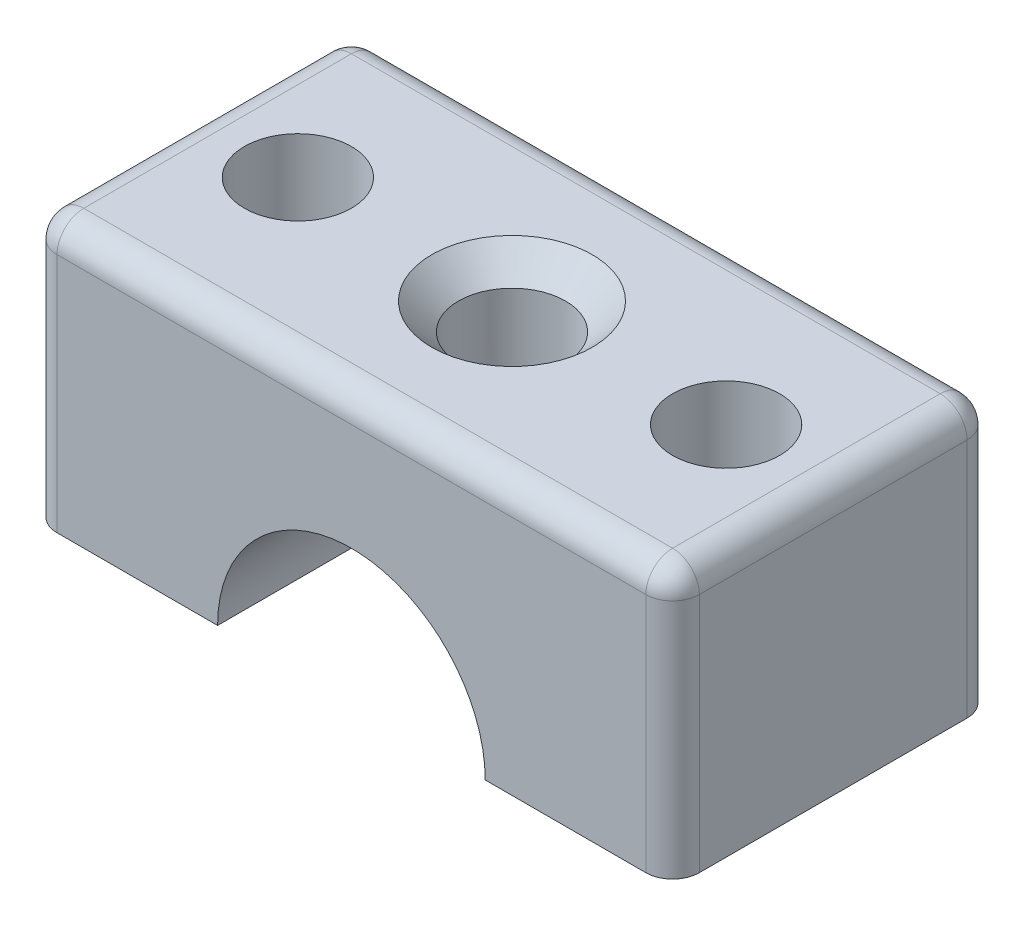
ISO-10303-21;
HEADER;
FILE_DESCRIPTION(('STEP AP214'),'2;1');
FILE_NAME('part.step','',(''),(''),'','','');
FILE_SCHEMA(('AUTOMOTIVE_DESIGN { 1 0 10303 214 1 1 1 1 }'));
ENDSEC;
DATA;
#1=APPLICATION_CONTEXT('core data for automotive mechanical design processes');
#2=APPLICATION_PROTOCOL_DEFINITION('international standard','automotive_design',2000,#1);
#3=PRODUCT_CONTEXT('',#1,'mechanical');
#4=PRODUCT('Part','Part','',(#3));
#5=PRODUCT_RELATED_PRODUCT_CATEGORY('part','',(#4));
#6=PRODUCT_DEFINITION_FORMATION('','',#4);
#7=PRODUCT_DEFINITION_CONTEXT('part definition',#1,'design');
#8=PRODUCT_DEFINITION('design','',#6,#7);
#9=PRODUCT_DEFINITION_SHAPE('','',#8);
#10=(LENGTH_UNIT() NAMED_UNIT(*) SI_UNIT(.MILLI.,.METRE.));
#11=(NAMED_UNIT(*) PLANE_ANGLE_UNIT() SI_UNIT($,.RADIAN.));
#12=(NAMED_UNIT(*) SI_UNIT($,.STERADIAN.) SOLID_ANGLE_UNIT());
#13=UNCERTAINTY_MEASURE_WITH_UNIT(LENGTH_MEASURE(1.E-05),#10,'distance_accuracy_value','');
#14=(GEOMETRIC_REPRESENTATION_CONTEXT(3) GLOBAL_UNCERTAINTY_ASSIGNED_CONTEXT((#13)) GLOBAL_UNIT_ASSIGNED_CONTEXT((#10,
#11,#12)) REPRESENTATION_CONTEXT('',''));
#15=CARTESIAN_POINT('',(0.,0.,0.));
#16=DIRECTION('',(0.,0.,1.));
#17=DIRECTION('',(1.,0.,0.));
#18=AXIS2_PLACEMENT_3D('',#15,#16,#17);
#19=CARTESIAN_POINT('',(0.,0.,0.));
#20=DIRECTION('',(0.,1.,0.));
#21=DIRECTION('',(0.,0.,1.));
#22=AXIS2_PLACEMENT_3D('',#19,#20,#21);
#23=PLANE('',#22);
#24=CARTESIAN_POINT('',(8.,0.,0.));
#25=DIRECTION('',(0.,1.,0.));
#26=DIRECTION('',(0.,0.,1.));
#27=AXIS2_PLACEMENT_3D('',#24,#25,#26);
#28=CIRCLE('',#27,2.);
#29=CARTESIAN_POINT('',(8.,0.,2.));
#30=VERTEX_POINT('',#29);
#31=EDGE_CURVE('E291',#30,#30,#28,.T.);
#32=ORIENTED_EDGE('',*,*,#31,.T.);
#33=EDGE_LOOP('',(#32));
#34=FACE_BOUND('',#33,.T.);
#35=DIRECTION('',(1.,0.,0.));
#36=VECTOR('',#35,1.);
#37=CARTESIAN_POINT('',(-12.,0.,6.));
#38=LINE('',#37,#36);
#39=CARTESIAN_POINT('',(5.,0.,6.));
#40=VERTEX_POINT('',#39);
#41=CARTESIAN_POINT('',(11.,0.,6.));
#42=VERTEX_POINT('',#41);
#43=EDGE_CURVE('E163',#40,#42,#38,.T.);
#44=ORIENTED_EDGE('',*,*,#43,.F.);
#45=DIRECTION('',(0.,0.,-1.));
#46=VECTOR('',#45,1.);
#47=CARTESIAN_POINT('',(5.,0.,6.));
#48=LINE('',#47,#46);
#49=CARTESIAN_POINT('',(5.,0.,-6.));
#50=VERTEX_POINT('',#49);
#51=EDGE_CURVE('E66',#40,#50,#48,.T.);
#52=ORIENTED_EDGE('',*,*,#51,.T.);
#53=DIRECTION('',(-1.,0.,0.));
#54=VECTOR('',#53,1.);
#55=CARTESIAN_POINT('',(-12.,0.,-6.));
#56=LINE('',#55,#54);
#57=CARTESIAN_POINT('',(11.,0.,-6.));
#58=VERTEX_POINT('',#57);
#59=EDGE_CURVE('E305',#58,#50,#56,.T.);
#60=ORIENTED_EDGE('',*,*,#59,.F.);
#61=CARTESIAN_POINT('',(11.,0.,-5.));
#62=DIRECTION('',(0.,1.,0.));
#63=DIRECTION('',(0.,0.,1.));
#64=AXIS2_PLACEMENT_3D('',#61,#62,#63);
#65=CIRCLE('',#64,1.);
#66=CARTESIAN_POINT('',(12.,0.,-5.));
#67=VERTEX_POINT('',#66);
#68=EDGE_CURVE('E194',#58,#67,#65,.F.);
#69=ORIENTED_EDGE('',*,*,#68,.T.);
#70=DIRECTION('',(0.,0.,-1.));
#71=VECTOR('',#70,1.);
#72=CARTESIAN_POINT('',(12.,0.,-6.));
#73=LINE('',#72,#71);
#74=CARTESIAN_POINT('',(12.,0.,5.));
#75=VERTEX_POINT('',#74);
#76=EDGE_CURVE('E299',#75,#67,#73,.T.);
#77=ORIENTED_EDGE('',*,*,#76,.F.);
#78=CARTESIAN_POINT('',(11.,0.,5.));
#79=DIRECTION('',(0.,1.,0.));
#80=DIRECTION('',(0.,0.,1.));
#81=AXIS2_PLACEMENT_3D('',#78,#79,#80);
#82=CIRCLE('',#81,1.);
#83=EDGE_CURVE('E190',#75,#42,#82,.F.);
#84=ORIENTED_EDGE('',*,*,#83,.T.);
#85=EDGE_LOOP('',(#44,#52,#60,#69,#77,#84));
#86=FACE_BOUND('',#85,.T.);
#87=ADVANCED_FACE('F43',(#34,#86),#23,.F.);
#88=CARTESIAN_POINT('',(0.,10.,0.));
#89=DIRECTION('',(0.,1.,0.));
#90=DIRECTION('',(0.,0.,1.));
#91=AXIS2_PLACEMENT_3D('',#88,#89,#90);
#92=PLANE('',#91);
#93=DIRECTION('',(-1.,0.,0.));
#94=VECTOR('',#93,1.);
#95=CARTESIAN_POINT('',(-12.,10.,-5.));
#96=LINE('',#95,#94);
#97=CARTESIAN_POINT('',(11.,10.,-5.));
#98=VERTEX_POINT('',#97);
#99=CARTESIAN_POINT('',(-11.,10.,-5.));
#100=VERTEX_POINT('',#99);
#101=EDGE_CURVE('E58',#98,#100,#96,.T.);
#102=ORIENTED_EDGE('',*,*,#101,.T.);
#103=DIRECTION('',(0.,0.,1.));
#104=VECTOR('',#103,1.);
#105=CARTESIAN_POINT('',(-11.,10.,6.));
#106=LINE('',#105,#104);
#107=CARTESIAN_POINT('',(-11.,10.,5.));
#108=VERTEX_POINT('',#107);
#109=EDGE_CURVE('E11',#100,#108,#106,.T.);
#110=ORIENTED_EDGE('',*,*,#109,.T.);
#111=DIRECTION('',(1.,0.,0.));
#112=VECTOR('',#111,1.);
#113=CARTESIAN_POINT('',(12.,10.,5.));
#114=LINE('',#113,#112);
#115=CARTESIAN_POINT('',(11.,10.,5.));
#116=VERTEX_POINT('',#115);
#117=EDGE_CURVE('E226',#108,#116,#114,.T.);
#118=ORIENTED_EDGE('',*,*,#117,.T.);
#119=DIRECTION('',(0.,0.,-1.));
#120=VECTOR('',#119,1.);
#121=CARTESIAN_POINT('',(11.,10.,-6.));
#122=LINE('',#121,#120);
#123=EDGE_CURVE('E229',#116,#98,#122,.T.);
#124=ORIENTED_EDGE('',*,*,#123,.T.);
#125=EDGE_LOOP('',(#102,#110,#118,#124));
#126=FACE_BOUND('',#125,.T.);
#127=CARTESIAN_POINT('',(0.,10.,0.));
#128=DIRECTION('',(0.,1.,0.));
#129=DIRECTION('',(0.,0.,1.));
#130=AXIS2_PLACEMENT_3D('',#127,#128,#129);
#131=CIRCLE('',#130,3.);
#132=CARTESIAN_POINT('',(0.,10.,3.));
#133=VERTEX_POINT('',#132);
#134=EDGE_CURVE('E168',#133,#133,#131,.F.);
#135=ORIENTED_EDGE('',*,*,#134,.T.);
#136=EDGE_LOOP('',(#135));
#137=FACE_BOUND('',#136,.T.);
#138=CARTESIAN_POINT('',(-8.,10.,0.));
#139=DIRECTION('',(0.,1.,0.));
#140=DIRECTION('',(0.,0.,1.));
#141=AXIS2_PLACEMENT_3D('',#138,#139,#140);
#142=CIRCLE('',#141,2.);
#143=CARTESIAN_POINT('',(-8.,10.,2.));
#144=VERTEX_POINT('',#143);
#145=EDGE_CURVE('E286',#144,#144,#142,.T.);
#146=ORIENTED_EDGE('',*,*,#145,.F.);
#147=EDGE_LOOP('',(#146));
#148=FACE_BOUND('',#147,.T.);
#149=CARTESIAN_POINT('',(8.,10.,0.));
#150=DIRECTION('',(0.,1.,0.));
#151=DIRECTION('',(0.,0.,1.));
#152=AXIS2_PLACEMENT_3D('',#149,#150,#151);
#153=CIRCLE('',#152,2.);
#154=CARTESIAN_POINT('',(8.,10.,2.));
#155=VERTEX_POINT('',#154);
#156=EDGE_CURVE('E295',#155,#155,#153,.T.);
#157=ORIENTED_EDGE('',*,*,#156,.F.);
#158=EDGE_LOOP('',(#157));
#159=FACE_BOUND('',#158,.T.);
#160=ADVANCED_FACE('F376',(#126,#137,#148,#159),#92,.T.);
#161=CARTESIAN_POINT('',(-5.,0.,-6.));
#162=VERTEX_POINT('',#161);
#163=CARTESIAN_POINT('',(-11.,0.,-6.));
#164=VERTEX_POINT('',#163);
#165=EDGE_CURVE('E155',#162,#164,#56,.T.);
#166=ORIENTED_EDGE('',*,*,#165,.F.);
#167=DIRECTION('',(0.,0.,-1.));
#168=VECTOR('',#167,1.);
#169=CARTESIAN_POINT('',(-5.,0.,6.));
#170=LINE('',#169,#168);
#171=CARTESIAN_POINT('',(-5.,0.,6.));
#172=VERTEX_POINT('',#171);
#173=EDGE_CURVE('E139',#172,#162,#170,.T.);
#174=ORIENTED_EDGE('',*,*,#173,.F.);
#175=CARTESIAN_POINT('',(-11.,0.,6.));
#176=VERTEX_POINT('',#175);
#177=EDGE_CURVE('E152',#176,#172,#38,.T.);
#178=ORIENTED_EDGE('',*,*,#177,.F.);
#179=CARTESIAN_POINT('',(-11.,0.,5.));
#180=DIRECTION('',(0.,1.,0.));
#181=DIRECTION('',(0.,0.,1.));
#182=AXIS2_PLACEMENT_3D('',#179,#180,#181);
#183=CIRCLE('',#182,1.);
#184=CARTESIAN_POINT('',(-12.,0.,5.));
#185=VERTEX_POINT('',#184);
#186=EDGE_CURVE('E187',#176,#185,#183,.F.);
#187=ORIENTED_EDGE('',*,*,#186,.T.);
#188=DIRECTION('',(0.,0.,1.));
#189=VECTOR('',#188,1.);
#190=CARTESIAN_POINT('',(-12.,0.,-6.));
#191=LINE('',#190,#189);
#192=CARTESIAN_POINT('',(-12.,0.,-5.));
#193=VERTEX_POINT('',#192);
#194=EDGE_CURVE('E170',#193,#185,#191,.T.);
#195=ORIENTED_EDGE('',*,*,#194,.F.);
#196=CARTESIAN_POINT('',(-11.,0.,-5.));
#197=DIRECTION('',(0.,1.,0.));
#198=DIRECTION('',(0.,0.,1.));
#199=AXIS2_PLACEMENT_3D('',#196,#197,#198);
#200=CIRCLE('',#199,1.);
#201=EDGE_CURVE('E197',#193,#164,#200,.F.);
#202=ORIENTED_EDGE('',*,*,#201,.T.);
#203=EDGE_LOOP('',(#166,#174,#178,#187,#195,#202));
#204=FACE_BOUND('',#203,.T.);
#205=CARTESIAN_POINT('',(-8.,0.,0.));
#206=DIRECTION('',(0.,1.,0.));
#207=DIRECTION('',(0.,0.,1.));
#208=AXIS2_PLACEMENT_3D('',#205,#206,#207);
#209=CIRCLE('',#208,2.);
#210=CARTESIAN_POINT('',(-8.,0.,2.));
#211=VERTEX_POINT('',#210);
#212=EDGE_CURVE('E279',#211,#211,#209,.T.);
#213=ORIENTED_EDGE('',*,*,#212,.T.);
#214=EDGE_LOOP('',(#213));
#215=FACE_BOUND('',#214,.T.);
#216=ADVANCED_FACE('F150',(#204,#215),#23,.F.);
#217=CARTESIAN_POINT('',(12.,10.,-6.));
#218=DIRECTION('',(-1.,0.,0.));
#219=DIRECTION('',(0.,0.,1.));
#220=AXIS2_PLACEMENT_3D('',#217,#218,#219);
#221=PLANE('',#220);
#222=ORIENTED_EDGE('',*,*,#76,.T.);
#223=DIRECTION('',(0.,-1.,0.));
#224=VECTOR('',#223,1.);
#225=CARTESIAN_POINT('',(12.,10.,-5.));
#226=LINE('',#225,#224);
#227=CARTESIAN_POINT('',(12.,9.,-5.));
#228=VERTEX_POINT('',#227);
#229=EDGE_CURVE('E215',#67,#228,#226,.F.);
#230=ORIENTED_EDGE('',*,*,#229,.T.);
#231=DIRECTION('',(0.,0.,-1.));
#232=VECTOR('',#231,1.);
#233=CARTESIAN_POINT('',(12.,9.,6.));
#234=LINE('',#233,#232);
#235=CARTESIAN_POINT('',(12.,9.,5.));
#236=VERTEX_POINT('',#235);
#237=EDGE_CURVE('E209',#228,#236,#234,.F.);
#238=ORIENTED_EDGE('',*,*,#237,.T.);
#239=DIRECTION('',(0.,-1.,0.));
#240=VECTOR('',#239,1.);
#241=CARTESIAN_POINT('',(12.,10.,5.));
#242=LINE('',#241,#240);
#243=EDGE_CURVE('E212',#236,#75,#242,.T.);
#244=ORIENTED_EDGE('',*,*,#243,.T.);
#245=EDGE_LOOP('',(#222,#230,#238,#244));
#246=FACE_BOUND('',#245,.T.);
#247=ADVANCED_FACE('F343',(#246),#221,.F.);
#248=CARTESIAN_POINT('',(-12.,10.,-6.));
#249=DIRECTION('',(0.,0.,1.));
#250=DIRECTION('',(1.,0.,0.));
#251=AXIS2_PLACEMENT_3D('',#248,#249,#250);
#252=PLANE('',#251);
#253=ORIENTED_EDGE('',*,*,#59,.T.);
#254=CARTESIAN_POINT('',(0.,0.,-6.));
#255=DIRECTION('',(0.,0.,-1.));
#256=DIRECTION('',(-1.,0.,0.));
#257=AXIS2_PLACEMENT_3D('',#254,#255,#256);
#258=CIRCLE('',#257,5.);
#259=EDGE_CURVE('E145',#162,#50,#258,.T.);
#260=ORIENTED_EDGE('',*,*,#259,.F.);
#261=ORIENTED_EDGE('',*,*,#165,.T.);
#262=DIRECTION('',(0.,-1.,0.));
#263=VECTOR('',#262,1.);
#264=CARTESIAN_POINT('',(-11.,10.,-6.));
#265=LINE('',#264,#263);
#266=CARTESIAN_POINT('',(-11.,9.,-6.));
#267=VERTEX_POINT('',#266);
#268=EDGE_CURVE('E206',#164,#267,#265,.F.);
#269=ORIENTED_EDGE('',*,*,#268,.T.);
#270=DIRECTION('',(-1.,0.,0.));
#271=VECTOR('',#270,1.);
#272=CARTESIAN_POINT('',(12.,9.,-6.));
#273=LINE('',#272,#271);
#274=CARTESIAN_POINT('',(11.,9.,-6.));
#275=VERTEX_POINT('',#274);
#276=EDGE_CURVE('E200',#267,#275,#273,.F.);
#277=ORIENTED_EDGE('',*,*,#276,.T.);
#278=DIRECTION('',(0.,-1.,0.));
#279=VECTOR('',#278,1.);
#280=CARTESIAN_POINT('',(11.,10.,-6.));
#281=LINE('',#280,#279);
#282=EDGE_CURVE('E203',#275,#58,#281,.T.);
#283=ORIENTED_EDGE('',*,*,#282,.T.);
#284=EDGE_LOOP('',(#253,#260,#261,#269,#277,#283));
#285=FACE_BOUND('',#284,.T.);
#286=ADVANCED_FACE('F313',(#285),#252,.F.);
#287=CARTESIAN_POINT('',(-12.,10.,-6.));
#288=DIRECTION('',(1.,0.,0.));
#289=DIRECTION('',(0.,0.,-1.));
#290=AXIS2_PLACEMENT_3D('',#287,#288,#289);
#291=PLANE('',#290);
#292=DIRECTION('',(0.,0.,1.));
#293=VECTOR('',#292,1.);
#294=CARTESIAN_POINT('',(-12.,9.,-6.));
#295=LINE('',#294,#293);
#296=CARTESIAN_POINT('',(-12.,9.,5.));
#297=VERTEX_POINT('',#296);
#298=CARTESIAN_POINT('',(-12.,9.,-5.));
#299=VERTEX_POINT('',#298);
#300=EDGE_CURVE('E177',#297,#299,#295,.F.);
#301=ORIENTED_EDGE('',*,*,#300,.T.);
#302=DIRECTION('',(0.,-1.,0.));
#303=VECTOR('',#302,1.);
#304=CARTESIAN_POINT('',(-12.,10.,-5.));
#305=LINE('',#304,#303);
#306=EDGE_CURVE('E183',#299,#193,#305,.T.);
#307=ORIENTED_EDGE('',*,*,#306,.T.);
#308=ORIENTED_EDGE('',*,*,#194,.T.);
#309=DIRECTION('',(0.,-1.,0.));
#310=VECTOR('',#309,1.);
#311=CARTESIAN_POINT('',(-12.,10.,5.));
#312=LINE('',#311,#310);
#313=EDGE_CURVE('E180',#185,#297,#312,.F.);
#314=ORIENTED_EDGE('',*,*,#313,.T.);
#315=EDGE_LOOP('',(#301,#307,#308,#314));
#316=FACE_BOUND('',#315,.T.);
#317=ADVANCED_FACE('F391',(#316),#291,.F.);
#318=CARTESIAN_POINT('',(-12.,10.,6.));
#319=DIRECTION('',(0.,0.,-1.));
#320=DIRECTION('',(-1.,0.,0.));
#321=AXIS2_PLACEMENT_3D('',#318,#319,#320);
#322=PLANE('',#321);
#323=ORIENTED_EDGE('',*,*,#177,.T.);
#324=CARTESIAN_POINT('',(0.,0.,6.));
#325=DIRECTION('',(0.,0.,-1.));
#326=DIRECTION('',(-1.,0.,0.));
#327=AXIS2_PLACEMENT_3D('',#324,#325,#326);
#328=CIRCLE('',#327,5.);
#329=EDGE_CURVE('E136',#172,#40,#328,.T.);
#330=ORIENTED_EDGE('',*,*,#329,.T.);
#331=ORIENTED_EDGE('',*,*,#43,.T.);
#332=DIRECTION('',(0.,-1.,0.));
#333=VECTOR('',#332,1.);
#334=CARTESIAN_POINT('',(11.,10.,6.));
#335=LINE('',#334,#333);
#336=CARTESIAN_POINT('',(11.,9.,6.));
#337=VERTEX_POINT('',#336);
#338=EDGE_CURVE('E223',#42,#337,#335,.F.);
#339=ORIENTED_EDGE('',*,*,#338,.T.);
#340=DIRECTION('',(1.,0.,0.));
#341=VECTOR('',#340,1.);
#342=CARTESIAN_POINT('',(-12.,9.,6.));
#343=LINE('',#342,#341);
#344=CARTESIAN_POINT('',(-11.,9.,6.));
#345=VERTEX_POINT('',#344);
#346=EDGE_CURVE('E218',#337,#345,#343,.F.);
#347=ORIENTED_EDGE('',*,*,#346,.T.);
#348=DIRECTION('',(0.,-1.,0.));
#349=VECTOR('',#348,1.);
#350=CARTESIAN_POINT('',(-11.,10.,6.));
#351=LINE('',#350,#349);
#352=EDGE_CURVE('E160',#345,#176,#351,.T.);
#353=ORIENTED_EDGE('',*,*,#352,.T.);
#354=EDGE_LOOP('',(#323,#330,#331,#339,#347,#353));
#355=FACE_BOUND('',#354,.T.);
#356=ADVANCED_FACE('F158',(#355),#322,.F.);
#357=CARTESIAN_POINT('',(8.,10.,0.));
#358=DIRECTION('',(0.,-1.,0.));
#359=DIRECTION('',(0.,0.,-1.));
#360=AXIS2_PLACEMENT_3D('',#357,#358,#359);
#361=CYLINDRICAL_SURFACE('',#360,2.);
#362=ORIENTED_EDGE('',*,*,#156,.T.);
#363=EDGE_LOOP('',(#362));
#364=FACE_BOUND('',#363,.T.);
#365=ORIENTED_EDGE('',*,*,#31,.F.);
#366=EDGE_LOOP('',(#365));
#367=FACE_BOUND('',#366,.T.);
#368=ADVANCED_FACE('F397',(#364,#367),#361,.F.);
#369=CARTESIAN_POINT('',(-8.,10.,0.));
#370=DIRECTION('',(0.,-1.,0.));
#371=DIRECTION('',(0.,0.,-1.));
#372=AXIS2_PLACEMENT_3D('',#369,#370,#371);
#373=CYLINDRICAL_SURFACE('',#372,2.);
#374=ORIENTED_EDGE('',*,*,#145,.T.);
#375=EDGE_LOOP('',(#374));
#376=FACE_BOUND('',#375,.T.);
#377=ORIENTED_EDGE('',*,*,#212,.F.);
#378=EDGE_LOOP('',(#377));
#379=FACE_BOUND('',#378,.T.);
#380=ADVANCED_FACE('F361',(#376,#379),#373,.F.);
#381=CARTESIAN_POINT('',(0.,10.,0.));
#382=DIRECTION('',(0.,-1.,0.));
#383=DIRECTION('',(0.,0.,-1.));
#384=AXIS2_PLACEMENT_3D('',#381,#382,#383);
#385=CYLINDRICAL_SURFACE('',#384,2.);
#386=CARTESIAN_POINT('',(0.,5.,-2.));
#387=CARTESIAN_POINT('',(-0.107493005442891,4.99999271227084,-1.99999014817627));
#388=CARTESIAN_POINT('',(-0.215172564090673,4.99649294306932,-1.99128224791162));
#389=CARTESIAN_POINT('',(-0.427496480417896,4.98283453100642,-1.95675229647876));
#390=CARTESIAN_POINT('',(-0.532131777561248,4.97265778698877,-1.93088372091387));
#391=CARTESIAN_POINT('',(-0.734953922727403,4.94674209213118,-1.86312392194117));
#392=CARTESIAN_POINT('',(-0.833160661616959,4.93102136364072,-1.82128515378327));
#393=CARTESIAN_POINT('',(-1.02107197032837,4.89556610796078,-1.72298082667345));
#394=CARTESIAN_POINT('',(-1.11077947675099,4.87583297458057,-1.66652034508107));
#395=CARTESIAN_POINT('',(-1.28350100757039,4.83330886170419,-1.53776450143906));
#396=CARTESIAN_POINT('',(-1.36606227255021,4.8104229692919,-1.46489334375974));
#397=CARTESIAN_POINT('',(-1.51817500478472,4.76460576906194,-1.30659999652322));
#398=CARTESIAN_POINT('',(-1.58772010713353,4.74167444453792,-1.22117170278826));
#399=CARTESIAN_POINT('',(-1.71487456729288,4.69722791797136,-1.03557192975773));
#400=CARTESIAN_POINT('',(-1.77181498119547,4.67582115964951,-0.934913513976802));
#401=CARTESIAN_POINT('',(-1.86775471903715,4.63833647186792,-0.724463601579957));
#402=CARTESIAN_POINT('',(-1.90676256428583,4.62225601244176,-0.614676472151639));
#403=CARTESIAN_POINT('',(-1.96389882339587,4.59826357660818,-0.394287666407897));
#404=CARTESIAN_POINT('',(-1.98289396580565,4.59001420355605,-0.283948764423786));
#405=CARTESIAN_POINT('',(-2.00217296164003,4.58164004049144,-0.0613650016927319));
#406=CARTESIAN_POINT('',(-2.00246601631322,4.58151125522768,0.0508788946250152));
#407=CARTESIAN_POINT('',(-1.98498936750454,4.58910500279994,0.265756671458044));
#408=CARTESIAN_POINT('',(-1.96847531430514,4.5962817503845,0.368515714409031));
#409=CARTESIAN_POINT('',(-1.91994688029782,4.61676187607836,0.569659556006714));
#410=CARTESIAN_POINT('',(-1.88792979480463,4.63006632321673,0.668043588110308));
#411=CARTESIAN_POINT('',(-1.80869473255107,4.6615948508853,0.860017836196042));
#412=CARTESIAN_POINT('',(-1.76117986231532,4.67991379280788,0.953469239054691));
#413=CARTESIAN_POINT('',(-1.65250646073221,4.7193811638989,1.13141581636156));
#414=CARTESIAN_POINT('',(-1.59134280510084,4.74053065456848,1.21590760940281));
#415=CARTESIAN_POINT('',(-1.45155059945443,4.78526736742271,1.380409728802));
#416=CARTESIAN_POINT('',(-1.37193746297063,4.80891664976152,1.45956872944602));
#417=CARTESIAN_POINT('',(-1.20031442743019,4.85459824958282,1.60368447800204));
#418=CARTESIAN_POINT('',(-1.10830206533443,4.87663024445325,1.66863839741029));
#419=CARTESIAN_POINT('',(-0.912077652605842,4.91714681264548,1.78361744741583));
#420=CARTESIAN_POINT('',(-0.807660491346476,4.93555270095415,1.83332228119705));
#421=CARTESIAN_POINT('',(-0.591023765482881,4.96614828328759,1.91416786107806));
#422=CARTESIAN_POINT('',(-0.478808196849673,4.97834113462382,1.94531803755741));
#423=CARTESIAN_POINT('',(-0.256895887607819,4.99456139506911,1.9864482954197));
#424=CARTESIAN_POINT('',(-0.147443293985534,4.99902945833514,1.99757245425356));
#425=CARTESIAN_POINT('',(0.0718453098078178,5.00068478510631,2.00171310052861));
#426=CARTESIAN_POINT('',(0.181681213223924,4.99787393582291,1.99473428154751));
#427=CARTESIAN_POINT('',(0.393432739121988,4.98557567063753,1.96370824744801));
#428=CARTESIAN_POINT('',(0.495482491775475,4.97639391345523,1.94044201964902));
#429=CARTESIAN_POINT('',(0.694135428060781,4.952594414055,1.87856429169019));
#430=CARTESIAN_POINT('',(0.790737910224845,4.9379759735653,1.83995082033132));
#431=CARTESIAN_POINT('',(0.979078785816702,4.90416594770812,1.74721506032005));
#432=CARTESIAN_POINT('',(1.07057802275541,4.88484815979804,1.69265452795685));
#433=CARTESIAN_POINT('',(1.24344359124656,4.84373364745525,1.57005967609436));
#434=CARTESIAN_POINT('',(1.32480584076113,4.8219359311027,1.50201995707738));
#435=CARTESIAN_POINT('',(1.48072304302882,4.77645117638112,1.34912998705037));
#436=CARTESIAN_POINT('',(1.55447393380606,4.75273441425052,1.26346645849379));
#437=CARTESIAN_POINT('',(1.68675119741371,4.70741672917132,1.08055991699063));
#438=CARTESIAN_POINT('',(1.74527506133751,4.68581615526511,0.983314999660051));
#439=CARTESIAN_POINT('',(1.84580750193163,4.64714299907709,0.778538305405894));
#440=CARTESIAN_POINT('',(1.88765059453445,4.63011630884788,0.670916000787688));
#441=CARTESIAN_POINT('',(1.9522962197053,4.60323673477932,0.449266348284844));
#442=CARTESIAN_POINT('',(1.97511280526931,4.59337855695998,0.335243794187574));
#443=CARTESIAN_POINT('',(1.9997156172784,4.58271759299926,0.112872098225457));
#444=CARTESIAN_POINT('',(2.00289708230287,4.58131421008171,0.0047051604066492));
#445=CARTESIAN_POINT('',(1.99180315927752,4.58614836033098,-0.210544857713293));
#446=CARTESIAN_POINT('',(1.97752998791378,4.59238492324794,-0.317628073902584));
#447=CARTESIAN_POINT('',(1.93307136615365,4.61126649079021,-0.523332189855042));
#448=CARTESIAN_POINT('',(1.90353749357098,4.62364831827449,-0.622120274432999));
#449=CARTESIAN_POINT('',(1.83000544849101,4.65324001232696,-0.813378629613483));
#450=CARTESIAN_POINT('',(1.78600328139381,4.67045121206007,-0.905847146899826));
#451=CARTESIAN_POINT('',(1.68187276275973,4.70898609604491,-1.08760961927078));
#452=CARTESIAN_POINT('',(1.62096533515949,4.73048882313242,-1.17641867013048));
#453=CARTESIAN_POINT('',(1.4858921192715,4.77463804372237,-1.34299331720376));
#454=CARTESIAN_POINT('',(1.41172233481812,4.79728488048406,-1.42075557212832));
#455=CARTESIAN_POINT('',(1.24650550627246,4.84293567087394,-1.56820285326361));
#456=CARTESIAN_POINT('',(1.15467600114614,4.86586757962185,-1.63703730689807));
#457=CARTESIAN_POINT('',(0.959900320285779,4.90800406713717,-1.75833704262164));
#458=CARTESIAN_POINT('',(0.856949004547237,4.92720691092906,-1.81079471215253));
#459=CARTESIAN_POINT('',(0.644738062495202,4.95939714815861,-1.89662221519029));
#460=CARTESIAN_POINT('',(0.535631618219695,4.97249363055028,-1.93032932356034));
#461=CARTESIAN_POINT('',(0.31287654628122,4.99144306209366,-1.97863912095427));
#462=CARTESIAN_POINT('',(0.199243525858912,4.99731899495638,-1.9933024367439));
#463=CARTESIAN_POINT('',(0.0569122978909296,4.99975899504136,-1.99939538097827));
#464=CARTESIAN_POINT('',(0.0284626887407583,5.00000192969176,-2.00000260862919));
#465=CARTESIAN_POINT('',(0.,5.,-2.));
#466=B_SPLINE_CURVE_WITH_KNOTS('',3,(#386,#387,#388,#389,#390,#391,#392,#393,#394,#395,#396,
#397,#398,#399,#400,#401,#402,#403,#404,#405,#406,#407,#408,#409,#410,#411,#412,#413,#414,#415,
#416,#417,#418,#419,#420,#421,#422,#423,#424,#425,#426,#427,#428,#429,#430,#431,#432,#433,#434,
#435,#436,#437,#438,#439,#440,#441,#442,#443,#444,#445,#446,#447,#448,#449,#450,#451,#452,#453,
#454,#455,#456,#457,#458,#459,#460,#461,#462,#463,#464,#465),.UNSPECIFIED.,.T.,.F.,(4,2,2,2,2,2,
2,2,2,2,2,2,2,2,2,2,2,2,2,2,2,2,2,2,2,2,2,2,2,2,2,2,2,2,2,2,2,2,2,4),(0.,0.322402987893071,
0.645683636007934,0.967911457471581,1.29002753567984,1.62597381700397,1.96208394934411,
2.31315258819217,2.66405423118268,2.99904105308829,3.33386306340488,3.64538328401372,
3.95695787256047,4.27489126298816,4.59294421938183,4.93558349186557,5.27829092839733,
5.62776913162806,5.9770695611379,6.30569184528007,6.63422893570082,6.94800455564365,
7.26182048993797,7.58523513398263,7.90877959498969,8.25368474624414,8.59864669043748,
8.94695045140827,9.29499672645934,9.61799673392748,9.94095572563045,10.2511431854877,
10.5614163580516,10.8894546805669,11.2175920134839,11.5670042353384,11.9165786364053,
12.2596430101332,12.6016125240434,12.686980458968),.UNSPECIFIED.);
#467=CARTESIAN_POINT('',(0.,5.,-2.));
#468=VERTEX_POINT('',#467);
#469=EDGE_CURVE('E47',#468,#468,#466,.T.);
#470=ORIENTED_EDGE('',*,*,#469,.F.);
#471=EDGE_LOOP('',(#470));
#472=FACE_BOUND('',#471,.T.);
#473=CARTESIAN_POINT('',(0.,9.,0.));
#474=DIRECTION('',(0.,1.,0.));
#475=DIRECTION('',(0.,0.,1.));
#476=AXIS2_PLACEMENT_3D('',#473,#474,#475);
#477=CIRCLE('',#476,2.);
#478=CARTESIAN_POINT('',(0.,9.,2.));
#479=VERTEX_POINT('',#478);
#480=EDGE_CURVE('E162',#479,#479,#477,.T.);
#481=ORIENTED_EDGE('',*,*,#480,.T.);
#482=EDGE_LOOP('',(#481));
#483=FACE_BOUND('',#482,.T.);
#484=ADVANCED_FACE('F357',(#472,#483),#385,.F.);
#485=CARTESIAN_POINT('',(0.,9.,0.));
#486=DIRECTION('',(0.,1.,0.));
#487=DIRECTION('',(0.,0.,1.));
#488=AXIS2_PLACEMENT_3D('',#485,#486,#487);
#489=CONICAL_SURFACE('',#488,2.,0.78539816339745);
#490=ORIENTED_EDGE('',*,*,#134,.F.);
#491=EDGE_LOOP('',(#490));
#492=FACE_BOUND('',#491,.T.);
#493=ORIENTED_EDGE('',*,*,#480,.F.);
#494=EDGE_LOOP('',(#493));
#495=FACE_BOUND('',#494,.T.);
#496=ADVANCED_FACE('F360',(#492,#495),#489,.F.);
#497=CARTESIAN_POINT('',(11.,10.,5.));
#498=DIRECTION('',(0.,-1.,0.));
#499=DIRECTION('',(0.,0.,-1.));
#500=AXIS2_PLACEMENT_3D('',#497,#498,#499);
#501=CYLINDRICAL_SURFACE('',#500,1.);
#502=CARTESIAN_POINT('',(11.,9.,5.));
#503=DIRECTION('',(0.,1.,0.));
#504=DIRECTION('',(0.,0.,1.));
#505=AXIS2_PLACEMENT_3D('',#502,#503,#504);
#506=CIRCLE('',#505,1.);
#507=EDGE_CURVE('E276',#337,#236,#506,.T.);
#508=ORIENTED_EDGE('',*,*,#507,.F.);
#509=ORIENTED_EDGE('',*,*,#338,.F.);
#510=ORIENTED_EDGE('',*,*,#83,.F.);
#511=ORIENTED_EDGE('',*,*,#243,.F.);
#512=EDGE_LOOP('',(#508,#509,#510,#511));
#513=FACE_BOUND('',#512,.T.);
#514=ADVANCED_FACE('F45',(#513),#501,.T.);
#515=CARTESIAN_POINT('',(11.,9.,5.));
#516=DIRECTION('',(1.,0.,0.));
#517=DIRECTION('',(0.,0.,-1.));
#518=AXIS2_PLACEMENT_3D('',#515,#516,#517);
#519=SPHERICAL_SURFACE('',#518,1.);
#520=CARTESIAN_POINT('',(11.,9.,5.));
#521=DIRECTION('',(1.,0.,0.));
#522=DIRECTION('',(0.,0.,-1.));
#523=AXIS2_PLACEMENT_3D('',#520,#521,#522);
#524=CIRCLE('',#523,1.);
#525=EDGE_CURVE('E269',#337,#116,#524,.F.);
#526=ORIENTED_EDGE('',*,*,#525,.F.);
#527=ORIENTED_EDGE('',*,*,#507,.T.);
#528=CARTESIAN_POINT('',(11.,9.,5.));
#529=DIRECTION('',(0.,0.,1.));
#530=DIRECTION('',(0.,-1.,0.));
#531=AXIS2_PLACEMENT_3D('',#528,#529,#530);
#532=CIRCLE('',#531,1.);
#533=EDGE_CURVE('E273',#116,#236,#532,.F.);
#534=ORIENTED_EDGE('',*,*,#533,.F.);
#535=EDGE_LOOP('',(#526,#527,#534));
#536=FACE_BOUND('',#535,.T.);
#537=ADVANCED_FACE('F370',(#536),#519,.T.);
#538=CARTESIAN_POINT('',(11.,10.,-5.));
#539=DIRECTION('',(0.,-1.,0.));
#540=DIRECTION('',(0.,0.,-1.));
#541=AXIS2_PLACEMENT_3D('',#538,#539,#540);
#542=CYLINDRICAL_SURFACE('',#541,1.);
#543=ORIENTED_EDGE('',*,*,#68,.F.);
#544=ORIENTED_EDGE('',*,*,#282,.F.);
#545=CARTESIAN_POINT('',(11.,9.,-5.));
#546=DIRECTION('',(0.,1.,0.));
#547=DIRECTION('',(0.,0.,1.));
#548=AXIS2_PLACEMENT_3D('',#545,#546,#547);
#549=CIRCLE('',#548,1.);
#550=EDGE_CURVE('E265',#228,#275,#549,.T.);
#551=ORIENTED_EDGE('',*,*,#550,.F.);
#552=ORIENTED_EDGE('',*,*,#229,.F.);
#553=EDGE_LOOP('',(#543,#544,#551,#552));
#554=FACE_BOUND('',#553,.T.);
#555=ADVANCED_FACE('F332',(#554),#542,.T.);
#556=CARTESIAN_POINT('',(11.,9.,0.));
#557=DIRECTION('',(0.,0.,1.));
#558=DIRECTION('',(1.,0.,0.));
#559=AXIS2_PLACEMENT_3D('',#556,#557,#558);
#560=CYLINDRICAL_SURFACE('',#559,1.);
#561=ORIENTED_EDGE('',*,*,#533,.T.);
#562=ORIENTED_EDGE('',*,*,#237,.F.);
#563=CARTESIAN_POINT('',(11.,9.,-5.));
#564=DIRECTION('',(0.,0.,-1.));
#565=DIRECTION('',(-1.,0.,0.));
#566=AXIS2_PLACEMENT_3D('',#563,#564,#565);
#567=CIRCLE('',#566,1.);
#568=EDGE_CURVE('E261',#98,#228,#567,.T.);
#569=ORIENTED_EDGE('',*,*,#568,.F.);
#570=ORIENTED_EDGE('',*,*,#123,.F.);
#571=EDGE_LOOP('',(#561,#562,#569,#570));
#572=FACE_BOUND('',#571,.T.);
#573=ADVANCED_FACE('F340',(#572),#560,.T.);
#574=CARTESIAN_POINT('',(0.,9.,5.));
#575=DIRECTION('',(-1.,0.,0.));
#576=DIRECTION('',(0.,0.,1.));
#577=AXIS2_PLACEMENT_3D('',#574,#575,#576);
#578=CYLINDRICAL_SURFACE('',#577,1.);
#579=ORIENTED_EDGE('',*,*,#525,.T.);
#580=ORIENTED_EDGE('',*,*,#117,.F.);
#581=CARTESIAN_POINT('',(-11.,9.,5.));
#582=DIRECTION('',(-1.,0.,0.));
#583=DIRECTION('',(0.,-1.,0.));
#584=AXIS2_PLACEMENT_3D('',#581,#582,#583);
#585=CIRCLE('',#584,1.);
#586=EDGE_CURVE('E257',#345,#108,#585,.T.);
#587=ORIENTED_EDGE('',*,*,#586,.F.);
#588=ORIENTED_EDGE('',*,*,#346,.F.);
#589=EDGE_LOOP('',(#579,#580,#587,#588));
#590=FACE_BOUND('',#589,.T.);
#591=ADVANCED_FACE('F435',(#590),#578,.T.);
#592=CARTESIAN_POINT('',(-11.,10.,5.));
#593=DIRECTION('',(0.,-1.,0.));
#594=DIRECTION('',(0.,0.,-1.));
#595=AXIS2_PLACEMENT_3D('',#592,#593,#594);
#596=CYLINDRICAL_SURFACE('',#595,1.);
#597=ORIENTED_EDGE('',*,*,#186,.F.);
#598=ORIENTED_EDGE('',*,*,#352,.F.);
#599=CARTESIAN_POINT('',(-11.,9.,5.));
#600=DIRECTION('',(0.,1.,0.));
#601=DIRECTION('',(0.,0.,1.));
#602=AXIS2_PLACEMENT_3D('',#599,#600,#601);
#603=CIRCLE('',#602,1.);
#604=EDGE_CURVE('E253',#297,#345,#603,.T.);
#605=ORIENTED_EDGE('',*,*,#604,.F.);
#606=ORIENTED_EDGE('',*,*,#313,.F.);
#607=EDGE_LOOP('',(#597,#598,#605,#606));
#608=FACE_BOUND('',#607,.T.);
#609=ADVANCED_FACE('F432',(#608),#596,.T.);
#610=CARTESIAN_POINT('',(11.,9.,-5.));
#611=DIRECTION('',(1.,0.,0.));
#612=DIRECTION('',(0.,0.,-1.));
#613=AXIS2_PLACEMENT_3D('',#610,#611,#612);
#614=SPHERICAL_SURFACE('',#613,1.);
#615=ORIENTED_EDGE('',*,*,#568,.T.);
#616=ORIENTED_EDGE('',*,*,#550,.T.);
#617=CARTESIAN_POINT('',(11.,9.,-5.));
#618=DIRECTION('',(1.,0.,0.));
#619=DIRECTION('',(0.,1.,0.));
#620=AXIS2_PLACEMENT_3D('',#617,#618,#619);
#621=CIRCLE('',#620,1.);
#622=EDGE_CURVE('E249',#98,#275,#621,.F.);
#623=ORIENTED_EDGE('',*,*,#622,.F.);
#624=EDGE_LOOP('',(#615,#616,#623));
#625=FACE_BOUND('',#624,.T.);
#626=ADVANCED_FACE('F335',(#625),#614,.T.);
#627=CARTESIAN_POINT('',(-11.,9.,5.));
#628=DIRECTION('',(0.,0.,1.));
#629=DIRECTION('',(1.,0.,0.));
#630=AXIS2_PLACEMENT_3D('',#627,#628,#629);
#631=SPHERICAL_SURFACE('',#630,1.);
#632=ORIENTED_EDGE('',*,*,#604,.T.);
#633=ORIENTED_EDGE('',*,*,#586,.T.);
#634=CARTESIAN_POINT('',(-11.,9.,5.));
#635=DIRECTION('',(0.,0.,1.));
#636=DIRECTION('',(1.,0.,0.));
#637=AXIS2_PLACEMENT_3D('',#634,#635,#636);
#638=CIRCLE('',#637,1.);
#639=EDGE_CURVE('E246',#297,#108,#638,.F.);
#640=ORIENTED_EDGE('',*,*,#639,.F.);
#641=EDGE_LOOP('',(#632,#633,#640));
#642=FACE_BOUND('',#641,.T.);
#643=ADVANCED_FACE('F426',(#642),#631,.T.);
#644=CARTESIAN_POINT('',(0.,9.,-5.));
#645=DIRECTION('',(1.,0.,0.));
#646=DIRECTION('',(0.,0.,-1.));
#647=AXIS2_PLACEMENT_3D('',#644,#645,#646);
#648=CYLINDRICAL_SURFACE('',#647,1.);
#649=ORIENTED_EDGE('',*,*,#622,.T.);
#650=ORIENTED_EDGE('',*,*,#276,.F.);
#651=CARTESIAN_POINT('',(-11.,9.,-5.));
#652=DIRECTION('',(-1.,0.,0.));
#653=DIRECTION('',(0.,0.,1.));
#654=AXIS2_PLACEMENT_3D('',#651,#652,#653);
#655=CIRCLE('',#654,1.);
#656=EDGE_CURVE('E242',#100,#267,#655,.T.);
#657=ORIENTED_EDGE('',*,*,#656,.F.);
#658=ORIENTED_EDGE('',*,*,#101,.F.);
#659=EDGE_LOOP('',(#649,#650,#657,#658));
#660=FACE_BOUND('',#659,.T.);
#661=ADVANCED_FACE('F326',(#660),#648,.T.);
#662=CARTESIAN_POINT('',(-11.,9.,0.));
#663=DIRECTION('',(0.,0.,-1.));
#664=DIRECTION('',(-1.,0.,0.));
#665=AXIS2_PLACEMENT_3D('',#662,#663,#664);
#666=CYLINDRICAL_SURFACE('',#665,1.);
#667=ORIENTED_EDGE('',*,*,#639,.T.);
#668=ORIENTED_EDGE('',*,*,#109,.F.);
#669=CARTESIAN_POINT('',(-11.,9.,-5.));
#670=DIRECTION('',(0.,0.,-1.));
#671=DIRECTION('',(-1.,0.,0.));
#672=AXIS2_PLACEMENT_3D('',#669,#670,#671);
#673=CIRCLE('',#672,1.);
#674=EDGE_CURVE('E238',#299,#100,#673,.T.);
#675=ORIENTED_EDGE('',*,*,#674,.F.);
#676=ORIENTED_EDGE('',*,*,#300,.F.);
#677=EDGE_LOOP('',(#667,#668,#675,#676));
#678=FACE_BOUND('',#677,.T.);
#679=ADVANCED_FACE('F418',(#678),#666,.T.);
#680=CARTESIAN_POINT('',(-11.,9.,-5.));
#681=DIRECTION('',(0.,1.,0.));
#682=DIRECTION('',(-1.,0.,0.));
#683=AXIS2_PLACEMENT_3D('',#680,#681,#682);
#684=SPHERICAL_SURFACE('',#683,1.);
#685=ORIENTED_EDGE('',*,*,#674,.T.);
#686=ORIENTED_EDGE('',*,*,#656,.T.);
#687=CARTESIAN_POINT('',(-11.,9.,-5.));
#688=DIRECTION('',(0.,1.,0.));
#689=DIRECTION('',(0.,0.,1.));
#690=AXIS2_PLACEMENT_3D('',#687,#688,#689);
#691=CIRCLE('',#690,1.);
#692=EDGE_CURVE('E234',#299,#267,#691,.F.);
#693=ORIENTED_EDGE('',*,*,#692,.F.);
#694=EDGE_LOOP('',(#685,#686,#693));
#695=FACE_BOUND('',#694,.T.);
#696=ADVANCED_FACE('F322',(#695),#684,.T.);
#697=CARTESIAN_POINT('',(-11.,10.,-5.));
#698=DIRECTION('',(0.,-1.,0.));
#699=DIRECTION('',(0.,0.,-1.));
#700=AXIS2_PLACEMENT_3D('',#697,#698,#699);
#701=CYLINDRICAL_SURFACE('',#700,1.);
#702=ORIENTED_EDGE('',*,*,#692,.T.);
#703=ORIENTED_EDGE('',*,*,#268,.F.);
#704=ORIENTED_EDGE('',*,*,#201,.F.);
#705=ORIENTED_EDGE('',*,*,#306,.F.);
#706=EDGE_LOOP('',(#702,#703,#704,#705));
#707=FACE_BOUND('',#706,.T.);
#708=ADVANCED_FACE('F319',(#707),#701,.T.);
#709=CARTESIAN_POINT('',(0.,0.,6.));
#710=DIRECTION('',(0.,0.,-1.));
#711=DIRECTION('',(-1.,0.,0.));
#712=AXIS2_PLACEMENT_3D('',#709,#710,#711);
#713=CYLINDRICAL_SURFACE('',#712,5.);
#714=ORIENTED_EDGE('',*,*,#469,.T.);
#715=EDGE_LOOP('',(#714));
#716=FACE_BOUND('',#715,.T.);
#717=ORIENTED_EDGE('',*,*,#259,.T.);
#718=ORIENTED_EDGE('',*,*,#51,.F.);
#719=ORIENTED_EDGE('',*,*,#329,.F.);
#720=ORIENTED_EDGE('',*,*,#173,.T.);
#721=EDGE_LOOP('',(#717,#718,#719,#720));
#722=FACE_BOUND('',#721,.T.);
#723=ADVANCED_FACE('F138',(#716,#722),#713,.F.);
#724=CLOSED_SHELL('',(#87,#160,#216,#247,#286,#317,#356,#368,#380,#484,#496,#514,#537,#555,#573,
#591,#609,#626,#643,#661,#679,#696,#708,#723));
#725=MANIFOLD_SOLID_BREP('B2',#724);
#726=ADVANCED_BREP_SHAPE_REPRESENTATION('',(#18,#725),#14);
#727=SHAPE_DEFINITION_REPRESENTATION(#9,#726);
ENDSEC;
END-ISO-10303-21;
